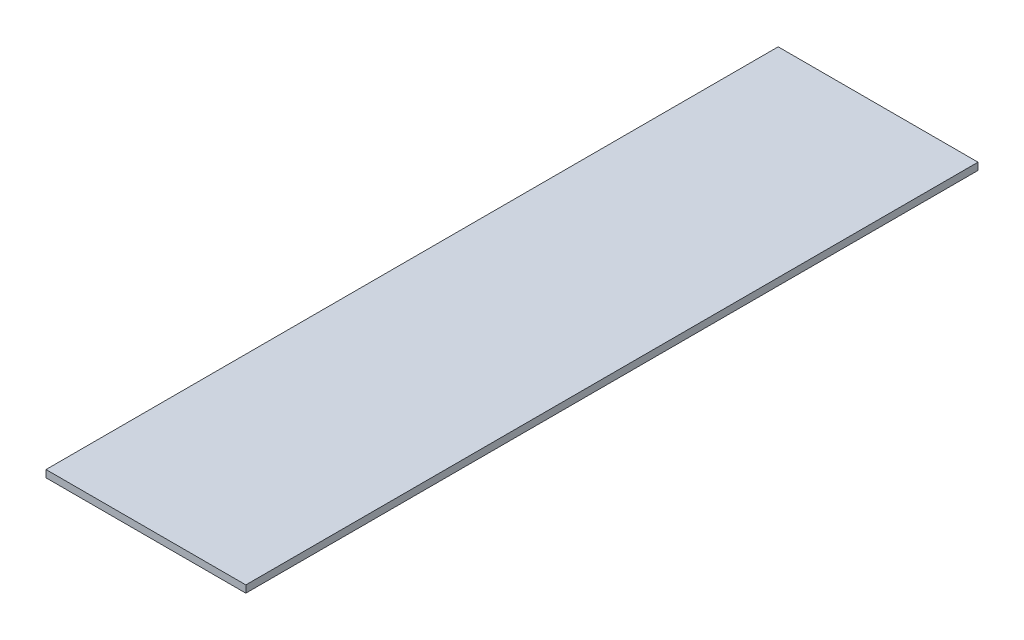
ISO-10303-21;
HEADER;
FILE_DESCRIPTION(('STEP AP214'),'2;1');
FILE_NAME('part.step','',(''),(''),'','','');
FILE_SCHEMA(('AUTOMOTIVE_DESIGN { 1 0 10303 214 1 1 1 1 }'));
ENDSEC;
DATA;
#1=APPLICATION_CONTEXT('core data for automotive mechanical design processes');
#2=APPLICATION_PROTOCOL_DEFINITION('international standard','automotive_design',2000,#1);
#3=PRODUCT_CONTEXT('',#1,'mechanical');
#4=PRODUCT('Part','Part','',(#3));
#5=PRODUCT_RELATED_PRODUCT_CATEGORY('part','',(#4));
#6=PRODUCT_DEFINITION_FORMATION('','',#4);
#7=PRODUCT_DEFINITION_CONTEXT('part definition',#1,'design');
#8=PRODUCT_DEFINITION('design','',#6,#7);
#9=PRODUCT_DEFINITION_SHAPE('','',#8);
#10=(LENGTH_UNIT() NAMED_UNIT(*) SI_UNIT(.MILLI.,.METRE.));
#11=(NAMED_UNIT(*) PLANE_ANGLE_UNIT() SI_UNIT($,.RADIAN.));
#12=(NAMED_UNIT(*) SI_UNIT($,.STERADIAN.) SOLID_ANGLE_UNIT());
#13=UNCERTAINTY_MEASURE_WITH_UNIT(LENGTH_MEASURE(1.E-05),#10,'distance_accuracy_value','');
#14=(GEOMETRIC_REPRESENTATION_CONTEXT(3) GLOBAL_UNCERTAINTY_ASSIGNED_CONTEXT((#13)) GLOBAL_UNIT_ASSIGNED_CONTEXT((#10,
#11,#12)) REPRESENTATION_CONTEXT('',''));
#15=CARTESIAN_POINT('',(0.,0.,0.));
#16=DIRECTION('',(0.,0.,1.));
#17=DIRECTION('',(1.,0.,0.));
#18=AXIS2_PLACEMENT_3D('',#15,#16,#17);
#19=CARTESIAN_POINT('',(-12.5,0.9,-200.729625));
#20=DIRECTION('',(1.,0.,0.));
#21=DIRECTION('',(0.,0.,-1.));
#22=AXIS2_PLACEMENT_3D('',#19,#20,#21);
#23=PLANE('',#22);
#24=DIRECTION('',(0.,0.,1.));
#25=VECTOR('',#24,1.);
#26=CARTESIAN_POINT('',(-12.5,0.,-200.729625));
#27=LINE('',#26,#25);
#28=CARTESIAN_POINT('',(-12.5,0.,-200.729625));
#29=VERTEX_POINT('',#28);
#30=CARTESIAN_POINT('',(-12.5,0.,-109.129625));
#31=VERTEX_POINT('',#30);
#32=EDGE_CURVE('E97',#29,#31,#27,.T.);
#33=ORIENTED_EDGE('',*,*,#32,.T.);
#34=DIRECTION('',(0.,-1.,0.));
#35=VECTOR('',#34,1.);
#36=CARTESIAN_POINT('',(-12.5,0.9,-109.129625));
#37=LINE('',#36,#35);
#38=CARTESIAN_POINT('',(-12.5,0.9,-109.129625));
#39=VERTEX_POINT('',#38);
#40=EDGE_CURVE('E11',#39,#31,#37,.T.);
#41=ORIENTED_EDGE('',*,*,#40,.F.);
#42=DIRECTION('',(0.,0.,1.));
#43=VECTOR('',#42,1.);
#44=CARTESIAN_POINT('',(-12.5,0.9,-200.729625));
#45=LINE('',#44,#43);
#46=CARTESIAN_POINT('',(-12.5,0.9,-200.729625));
#47=VERTEX_POINT('',#46);
#48=EDGE_CURVE('E85',#47,#39,#45,.T.);
#49=ORIENTED_EDGE('',*,*,#48,.F.);
#50=DIRECTION('',(0.,-1.,0.));
#51=VECTOR('',#50,1.);
#52=CARTESIAN_POINT('',(-12.5,0.9,-200.729625));
#53=LINE('',#52,#51);
#54=EDGE_CURVE('E93',#47,#29,#53,.T.);
#55=ORIENTED_EDGE('',*,*,#54,.T.);
#56=EDGE_LOOP('',(#33,#41,#49,#55));
#57=FACE_BOUND('',#56,.T.);
#58=ADVANCED_FACE('F34',(#57),#23,.F.);
#59=CARTESIAN_POINT('',(-12.5,0.9,-109.129625));
#60=DIRECTION('',(0.,0.,-1.));
#61=DIRECTION('',(-1.,0.,0.));
#62=AXIS2_PLACEMENT_3D('',#59,#60,#61);
#63=PLANE('',#62);
#64=DIRECTION('',(1.,0.,0.));
#65=VECTOR('',#64,1.);
#66=CARTESIAN_POINT('',(-12.5,0.,-109.129625));
#67=LINE('',#66,#65);
#68=CARTESIAN_POINT('',(12.5,0.,-109.129625));
#69=VERTEX_POINT('',#68);
#70=EDGE_CURVE('E89',#31,#69,#67,.T.);
#71=ORIENTED_EDGE('',*,*,#70,.T.);
#72=DIRECTION('',(0.,-1.,0.));
#73=VECTOR('',#72,1.);
#74=CARTESIAN_POINT('',(12.5,0.9,-109.129625));
#75=LINE('',#74,#73);
#76=CARTESIAN_POINT('',(12.5,0.9,-109.129625));
#77=VERTEX_POINT('',#76);
#78=EDGE_CURVE('E42',#77,#69,#75,.T.);
#79=ORIENTED_EDGE('',*,*,#78,.F.);
#80=DIRECTION('',(1.,0.,0.));
#81=VECTOR('',#80,1.);
#82=CARTESIAN_POINT('',(-12.5,0.9,-109.129625));
#83=LINE('',#82,#81);
#84=EDGE_CURVE('E80',#39,#77,#83,.T.);
#85=ORIENTED_EDGE('',*,*,#84,.F.);
#86=ORIENTED_EDGE('',*,*,#40,.T.);
#87=EDGE_LOOP('',(#71,#79,#85,#86));
#88=FACE_BOUND('',#87,.T.);
#89=ADVANCED_FACE('F88',(#88),#63,.F.);
#90=CARTESIAN_POINT('',(12.5,0.9,-200.729625));
#91=DIRECTION('',(-1.,0.,0.));
#92=DIRECTION('',(0.,0.,1.));
#93=AXIS2_PLACEMENT_3D('',#90,#91,#92);
#94=PLANE('',#93);
#95=DIRECTION('',(0.,0.,-1.));
#96=VECTOR('',#95,1.);
#97=CARTESIAN_POINT('',(12.5,0.,-200.729625));
#98=LINE('',#97,#96);
#99=CARTESIAN_POINT('',(12.5,0.,-200.729625));
#100=VERTEX_POINT('',#99);
#101=EDGE_CURVE('E67',#69,#100,#98,.T.);
#102=ORIENTED_EDGE('',*,*,#101,.T.);
#103=DIRECTION('',(0.,-1.,0.));
#104=VECTOR('',#103,1.);
#105=CARTESIAN_POINT('',(12.5,0.9,-200.729625));
#106=LINE('',#105,#104);
#107=CARTESIAN_POINT('',(12.5,0.9,-200.729625));
#108=VERTEX_POINT('',#107);
#109=EDGE_CURVE('E90',#108,#100,#106,.T.);
#110=ORIENTED_EDGE('',*,*,#109,.F.);
#111=DIRECTION('',(0.,0.,-1.));
#112=VECTOR('',#111,1.);
#113=CARTESIAN_POINT('',(12.5,0.9,-200.729625));
#114=LINE('',#113,#112);
#115=EDGE_CURVE('E83',#77,#108,#114,.T.);
#116=ORIENTED_EDGE('',*,*,#115,.F.);
#117=ORIENTED_EDGE('',*,*,#78,.T.);
#118=EDGE_LOOP('',(#102,#110,#116,#117));
#119=FACE_BOUND('',#118,.T.);
#120=ADVANCED_FACE('F91',(#119),#94,.F.);
#121=CARTESIAN_POINT('',(-12.5,0.9,-200.729625));
#122=DIRECTION('',(0.,0.,1.));
#123=DIRECTION('',(1.,0.,0.));
#124=AXIS2_PLACEMENT_3D('',#121,#122,#123);
#125=PLANE('',#124);
#126=DIRECTION('',(-1.,0.,0.));
#127=VECTOR('',#126,1.);
#128=CARTESIAN_POINT('',(-12.5,0.,-200.729625));
#129=LINE('',#128,#127);
#130=EDGE_CURVE('E73',#100,#29,#129,.T.);
#131=ORIENTED_EDGE('',*,*,#130,.T.);
#132=ORIENTED_EDGE('',*,*,#54,.F.);
#133=DIRECTION('',(-1.,0.,0.));
#134=VECTOR('',#133,1.);
#135=CARTESIAN_POINT('',(-12.5,0.9,-200.729625));
#136=LINE('',#135,#134);
#137=EDGE_CURVE('E50',#108,#47,#136,.T.);
#138=ORIENTED_EDGE('',*,*,#137,.F.);
#139=ORIENTED_EDGE('',*,*,#109,.T.);
#140=EDGE_LOOP('',(#131,#132,#138,#139));
#141=FACE_BOUND('',#140,.T.);
#142=ADVANCED_FACE('F104',(#141),#125,.F.);
#143=CARTESIAN_POINT('',(-12.5,0.9,-109.129625));
#144=DIRECTION('',(0.,1.,0.));
#145=DIRECTION('',(0.,0.,1.));
#146=AXIS2_PLACEMENT_3D('',#143,#144,#145);
#147=PLANE('',#146);
#148=ORIENTED_EDGE('',*,*,#48,.T.);
#149=ORIENTED_EDGE('',*,*,#84,.T.);
#150=ORIENTED_EDGE('',*,*,#115,.T.);
#151=ORIENTED_EDGE('',*,*,#137,.T.);
#152=EDGE_LOOP('',(#148,#149,#150,#151));
#153=FACE_BOUND('',#152,.T.);
#154=ADVANCED_FACE('F81',(#153),#147,.T.);
#155=CARTESIAN_POINT('',(-12.5,0.,-109.129625));
#156=DIRECTION('',(0.,1.,0.));
#157=DIRECTION('',(0.,0.,1.));
#158=AXIS2_PLACEMENT_3D('',#155,#156,#157);
#159=PLANE('',#158);
#160=ORIENTED_EDGE('',*,*,#32,.F.);
#161=ORIENTED_EDGE('',*,*,#130,.F.);
#162=ORIENTED_EDGE('',*,*,#101,.F.);
#163=ORIENTED_EDGE('',*,*,#70,.F.);
#164=EDGE_LOOP('',(#160,#161,#162,#163));
#165=FACE_BOUND('',#164,.T.);
#166=ADVANCED_FACE('F107',(#165),#159,.F.);
#167=CLOSED_SHELL('',(#58,#89,#120,#142,#154,#166));
#168=MANIFOLD_SOLID_BREP('B2',#167);
#169=ADVANCED_BREP_SHAPE_REPRESENTATION('',(#18,#168),#14);
#170=SHAPE_DEFINITION_REPRESENTATION(#9,#169);
ENDSEC;
END-ISO-10303-21;
